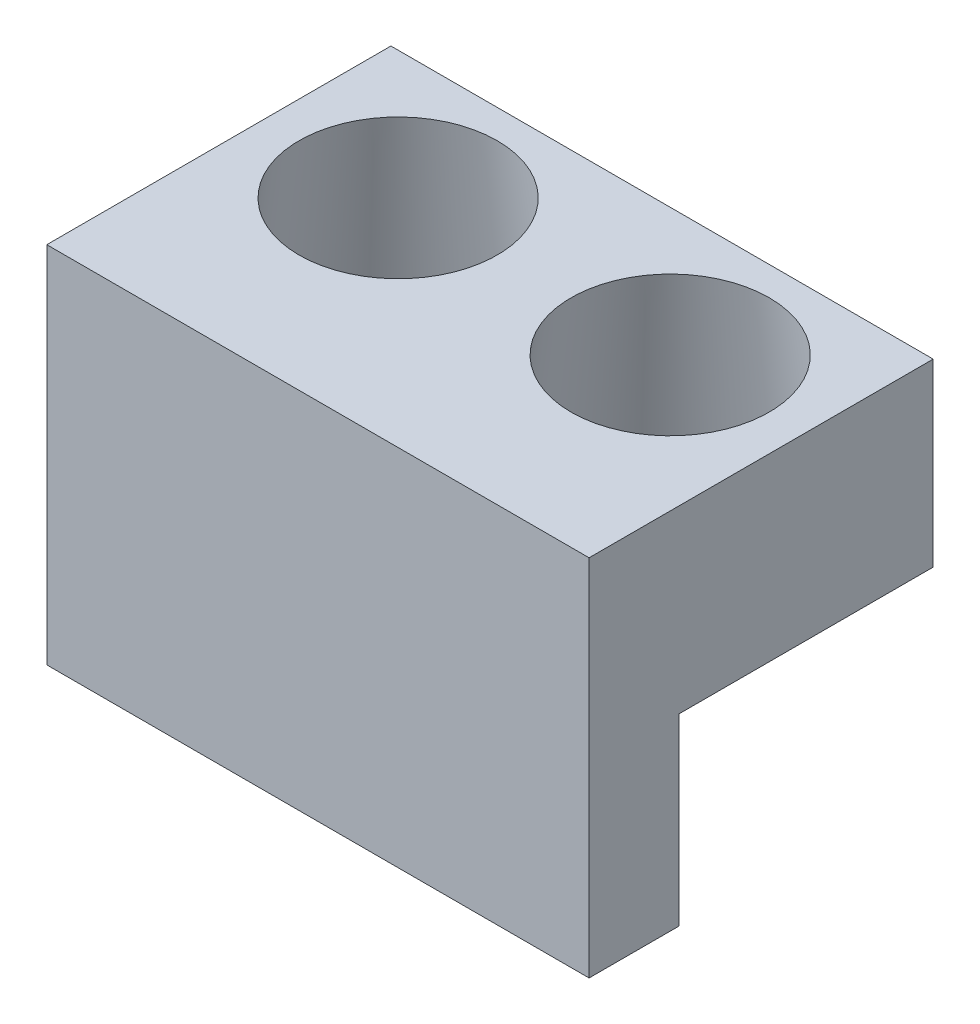
ISO-10303-21;
HEADER;
FILE_DESCRIPTION(('STEP AP214'),'2;1');
FILE_NAME('part.step','',(''),(''),'','','');
FILE_SCHEMA(('AUTOMOTIVE_DESIGN { 1 0 10303 214 1 1 1 1 }'));
ENDSEC;
DATA;
#1=APPLICATION_CONTEXT('core data for automotive mechanical design processes');
#2=APPLICATION_PROTOCOL_DEFINITION('international standard','automotive_design',2000,#1);
#3=PRODUCT_CONTEXT('',#1,'mechanical');
#4=PRODUCT('Part','Part','',(#3));
#5=PRODUCT_RELATED_PRODUCT_CATEGORY('part','',(#4));
#6=PRODUCT_DEFINITION_FORMATION('','',#4);
#7=PRODUCT_DEFINITION_CONTEXT('part definition',#1,'design');
#8=PRODUCT_DEFINITION('design','',#6,#7);
#9=PRODUCT_DEFINITION_SHAPE('','',#8);
#10=(LENGTH_UNIT() NAMED_UNIT(*) SI_UNIT(.MILLI.,.METRE.));
#11=(NAMED_UNIT(*) PLANE_ANGLE_UNIT() SI_UNIT($,.RADIAN.));
#12=(NAMED_UNIT(*) SI_UNIT($,.STERADIAN.) SOLID_ANGLE_UNIT());
#13=UNCERTAINTY_MEASURE_WITH_UNIT(LENGTH_MEASURE(1.E-05),#10,'distance_accuracy_value','');
#14=(GEOMETRIC_REPRESENTATION_CONTEXT(3) GLOBAL_UNCERTAINTY_ASSIGNED_CONTEXT((#13)) GLOBAL_UNIT_ASSIGNED_CONTEXT((#10,
#11,#12)) REPRESENTATION_CONTEXT('',''));
#15=CARTESIAN_POINT('',(0.,0.,0.));
#16=DIRECTION('',(0.,0.,1.));
#17=DIRECTION('',(1.,0.,0.));
#18=AXIS2_PLACEMENT_3D('',#15,#16,#17);
#19=CARTESIAN_POINT('',(38.227,51.308,12.7));
#20=DIRECTION('',(-1.,0.,0.));
#21=DIRECTION('',(0.,0.,1.));
#22=AXIS2_PLACEMENT_3D('',#19,#20,#21);
#23=PLANE('',#22);
#24=DIRECTION('',(0.,0.,-1.));
#25=VECTOR('',#24,1.);
#26=CARTESIAN_POINT('',(38.227,0.,12.7));
#27=LINE('',#26,#25);
#28=CARTESIAN_POINT('',(38.227,0.,12.7));
#29=VERTEX_POINT('',#28);
#30=CARTESIAN_POINT('',(38.227,0.,0.));
#31=VERTEX_POINT('',#30);
#32=EDGE_CURVE('E106',#29,#31,#27,.T.);
#33=ORIENTED_EDGE('',*,*,#32,.T.);
#34=DIRECTION('',(0.,-1.,0.));
#35=VECTOR('',#34,1.);
#36=CARTESIAN_POINT('',(38.227,51.308,0.));
#37=LINE('',#36,#35);
#38=CARTESIAN_POINT('',(38.227,25.908,0.));
#39=VERTEX_POINT('',#38);
#40=EDGE_CURVE('E12',#39,#31,#37,.T.);
#41=ORIENTED_EDGE('',*,*,#40,.F.);
#42=DIRECTION('',(0.,0.,-1.));
#43=VECTOR('',#42,1.);
#44=CARTESIAN_POINT('',(38.227,25.908,-35.814));
#45=LINE('',#44,#43);
#46=CARTESIAN_POINT('',(38.227,25.908,-35.814));
#47=VERTEX_POINT('',#46);
#48=EDGE_CURVE('E62',#39,#47,#45,.T.);
#49=ORIENTED_EDGE('',*,*,#48,.T.);
#50=DIRECTION('',(0.,1.,0.));
#51=VECTOR('',#50,1.);
#52=CARTESIAN_POINT('',(38.227,25.908,-35.814));
#53=LINE('',#52,#51);
#54=CARTESIAN_POINT('',(38.227,51.308,-35.814));
#55=VERTEX_POINT('',#54);
#56=EDGE_CURVE('E121',#47,#55,#53,.T.);
#57=ORIENTED_EDGE('',*,*,#56,.T.);
#58=DIRECTION('',(0.,0.,-1.));
#59=VECTOR('',#58,1.);
#60=CARTESIAN_POINT('',(38.227,51.308,12.7));
#61=LINE('',#60,#59);
#62=CARTESIAN_POINT('',(38.227,51.308,12.7));
#63=VERTEX_POINT('',#62);
#64=EDGE_CURVE('E100',#63,#55,#61,.T.);
#65=ORIENTED_EDGE('',*,*,#64,.F.);
#66=DIRECTION('',(0.,-1.,0.));
#67=VECTOR('',#66,1.);
#68=CARTESIAN_POINT('',(38.227,51.308,12.7));
#69=LINE('',#68,#67);
#70=EDGE_CURVE('E92',#63,#29,#69,.T.);
#71=ORIENTED_EDGE('',*,*,#70,.T.);
#72=EDGE_LOOP('',(#33,#41,#49,#57,#65,#71));
#73=FACE_BOUND('',#72,.T.);
#74=ADVANCED_FACE('F47',(#73),#23,.F.);
#75=CARTESIAN_POINT('',(-38.227,51.308,0.));
#76=DIRECTION('',(0.,0.,1.));
#77=DIRECTION('',(1.,0.,0.));
#78=AXIS2_PLACEMENT_3D('',#75,#76,#77);
#79=PLANE('',#78);
#80=DIRECTION('',(0.,-1.,0.));
#81=VECTOR('',#80,1.);
#82=CARTESIAN_POINT('',(-38.227,51.308,0.));
#83=LINE('',#82,#81);
#84=CARTESIAN_POINT('',(-38.227,25.908,0.));
#85=VERTEX_POINT('',#84);
#86=CARTESIAN_POINT('',(-38.227,0.,0.));
#87=VERTEX_POINT('',#86);
#88=EDGE_CURVE('E55',#85,#87,#83,.T.);
#89=ORIENTED_EDGE('',*,*,#88,.F.);
#90=DIRECTION('',(1.,0.,0.));
#91=VECTOR('',#90,1.);
#92=CARTESIAN_POINT('',(38.227,25.908,0.));
#93=LINE('',#92,#91);
#94=EDGE_CURVE('E139',#85,#39,#93,.T.);
#95=ORIENTED_EDGE('',*,*,#94,.T.);
#96=ORIENTED_EDGE('',*,*,#40,.T.);
#97=DIRECTION('',(-1.,0.,0.));
#98=VECTOR('',#97,1.);
#99=CARTESIAN_POINT('',(-38.227,0.,0.));
#100=LINE('',#99,#98);
#101=EDGE_CURVE('E113',#31,#87,#100,.T.);
#102=ORIENTED_EDGE('',*,*,#101,.T.);
#103=EDGE_LOOP('',(#89,#95,#96,#102));
#104=FACE_BOUND('',#103,.T.);
#105=ADVANCED_FACE('F138',(#104),#79,.F.);
#106=CARTESIAN_POINT('',(-38.227,51.308,0.));
#107=DIRECTION('',(1.,0.,0.));
#108=DIRECTION('',(0.,0.,-1.));
#109=AXIS2_PLACEMENT_3D('',#106,#107,#108);
#110=PLANE('',#109);
#111=DIRECTION('',(0.,0.,1.));
#112=VECTOR('',#111,1.);
#113=CARTESIAN_POINT('',(-38.227,0.,0.));
#114=LINE('',#113,#112);
#115=CARTESIAN_POINT('',(-38.227,0.,12.7));
#116=VERTEX_POINT('',#115);
#117=EDGE_CURVE('E101',#87,#116,#114,.T.);
#118=ORIENTED_EDGE('',*,*,#117,.T.);
#119=DIRECTION('',(0.,-1.,0.));
#120=VECTOR('',#119,1.);
#121=CARTESIAN_POINT('',(-38.227,51.308,12.7));
#122=LINE('',#121,#120);
#123=CARTESIAN_POINT('',(-38.227,51.308,12.7));
#124=VERTEX_POINT('',#123);
#125=EDGE_CURVE('E95',#124,#116,#122,.T.);
#126=ORIENTED_EDGE('',*,*,#125,.F.);
#127=DIRECTION('',(0.,0.,1.));
#128=VECTOR('',#127,1.);
#129=CARTESIAN_POINT('',(-38.227,51.308,0.));
#130=LINE('',#129,#128);
#131=CARTESIAN_POINT('',(-38.227,51.308,-35.814));
#132=VERTEX_POINT('',#131);
#133=EDGE_CURVE('E167',#132,#124,#130,.T.);
#134=ORIENTED_EDGE('',*,*,#133,.F.);
#135=DIRECTION('',(0.,1.,0.));
#136=VECTOR('',#135,1.);
#137=CARTESIAN_POINT('',(-38.227,25.908,-35.814));
#138=LINE('',#137,#136);
#139=CARTESIAN_POINT('',(-38.227,25.908,-35.814));
#140=VERTEX_POINT('',#139);
#141=EDGE_CURVE('E115',#140,#132,#138,.T.);
#142=ORIENTED_EDGE('',*,*,#141,.F.);
#143=DIRECTION('',(0.,0.,1.));
#144=VECTOR('',#143,1.);
#145=CARTESIAN_POINT('',(-38.227,25.908,0.));
#146=LINE('',#145,#144);
#147=EDGE_CURVE('E136',#140,#85,#146,.T.);
#148=ORIENTED_EDGE('',*,*,#147,.T.);
#149=ORIENTED_EDGE('',*,*,#88,.T.);
#150=EDGE_LOOP('',(#118,#126,#134,#142,#148,#149));
#151=FACE_BOUND('',#150,.T.);
#152=ADVANCED_FACE('F133',(#151),#110,.F.);
#153=CARTESIAN_POINT('',(-38.227,51.308,12.7));
#154=DIRECTION('',(0.,0.,-1.));
#155=DIRECTION('',(-1.,0.,0.));
#156=AXIS2_PLACEMENT_3D('',#153,#154,#155);
#157=PLANE('',#156);
#158=DIRECTION('',(1.,0.,0.));
#159=VECTOR('',#158,1.);
#160=CARTESIAN_POINT('',(-38.227,0.,12.7));
#161=LINE('',#160,#159);
#162=EDGE_CURVE('E89',#116,#29,#161,.T.);
#163=ORIENTED_EDGE('',*,*,#162,.T.);
#164=ORIENTED_EDGE('',*,*,#70,.F.);
#165=DIRECTION('',(1.,0.,0.));
#166=VECTOR('',#165,1.);
#167=CARTESIAN_POINT('',(-38.227,51.308,12.7));
#168=LINE('',#167,#166);
#169=EDGE_CURVE('E71',#124,#63,#168,.T.);
#170=ORIENTED_EDGE('',*,*,#169,.F.);
#171=ORIENTED_EDGE('',*,*,#125,.T.);
#172=EDGE_LOOP('',(#163,#164,#170,#171));
#173=FACE_BOUND('',#172,.T.);
#174=ADVANCED_FACE('F91',(#173),#157,.F.);
#175=CARTESIAN_POINT('',(0.,51.308,0.));
#176=DIRECTION('',(0.,-1.,0.));
#177=DIRECTION('',(0.,0.,-1.));
#178=AXIS2_PLACEMENT_3D('',#175,#176,#177);
#179=PLANE('',#178);
#180=CARTESIAN_POINT('',(-19.177,51.308,-17.78));
#181=DIRECTION('',(0.,1.,0.));
#182=DIRECTION('',(0.,0.,1.));
#183=AXIS2_PLACEMENT_3D('',#180,#181,#182);
#184=CIRCLE('',#183,13.97);
#185=CARTESIAN_POINT('',(-19.177,51.308,-3.81));
#186=VERTEX_POINT('',#185);
#187=EDGE_CURVE('E212',#186,#186,#184,.T.);
#188=ORIENTED_EDGE('',*,*,#187,.F.);
#189=EDGE_LOOP('',(#188));
#190=FACE_BOUND('',#189,.T.);
#191=CARTESIAN_POINT('',(19.177,51.308,-17.78));
#192=DIRECTION('',(0.,1.,0.));
#193=DIRECTION('',(0.,0.,1.));
#194=AXIS2_PLACEMENT_3D('',#191,#192,#193);
#195=CIRCLE('',#194,13.97);
#196=CARTESIAN_POINT('',(19.177,51.308,-3.80999999999999));
#197=VERTEX_POINT('',#196);
#198=EDGE_CURVE('E162',#197,#197,#195,.T.);
#199=ORIENTED_EDGE('',*,*,#198,.F.);
#200=EDGE_LOOP('',(#199));
#201=FACE_BOUND('',#200,.T.);
#202=ORIENTED_EDGE('',*,*,#64,.T.);
#203=DIRECTION('',(-1.,0.,0.));
#204=VECTOR('',#203,1.);
#205=CARTESIAN_POINT('',(-38.227,51.308,-35.814));
#206=LINE('',#205,#204);
#207=EDGE_CURVE('E154',#55,#132,#206,.T.);
#208=ORIENTED_EDGE('',*,*,#207,.T.);
#209=ORIENTED_EDGE('',*,*,#133,.T.);
#210=ORIENTED_EDGE('',*,*,#169,.T.);
#211=EDGE_LOOP('',(#202,#208,#209,#210));
#212=FACE_BOUND('',#211,.T.);
#213=ADVANCED_FACE('F171',(#190,#201,#212),#179,.F.);
#214=CARTESIAN_POINT('',(0.,0.,0.));
#215=DIRECTION('',(0.,-1.,0.));
#216=DIRECTION('',(0.,0.,-1.));
#217=AXIS2_PLACEMENT_3D('',#214,#215,#216);
#218=PLANE('',#217);
#219=ORIENTED_EDGE('',*,*,#32,.F.);
#220=ORIENTED_EDGE('',*,*,#162,.F.);
#221=ORIENTED_EDGE('',*,*,#117,.F.);
#222=ORIENTED_EDGE('',*,*,#101,.F.);
#223=EDGE_LOOP('',(#219,#220,#221,#222));
#224=FACE_BOUND('',#223,.T.);
#225=ADVANCED_FACE('F111',(#224),#218,.T.);
#226=CARTESIAN_POINT('',(-38.227,25.908,-35.814));
#227=DIRECTION('',(0.,0.,-1.));
#228=DIRECTION('',(-1.,0.,0.));
#229=AXIS2_PLACEMENT_3D('',#226,#227,#228);
#230=PLANE('',#229);
#231=ORIENTED_EDGE('',*,*,#207,.F.);
#232=ORIENTED_EDGE('',*,*,#56,.F.);
#233=DIRECTION('',(-1.,0.,0.));
#234=VECTOR('',#233,1.);
#235=CARTESIAN_POINT('',(-38.227,25.908,-35.814));
#236=LINE('',#235,#234);
#237=EDGE_CURVE('E148',#47,#140,#236,.T.);
#238=ORIENTED_EDGE('',*,*,#237,.T.);
#239=ORIENTED_EDGE('',*,*,#141,.T.);
#240=EDGE_LOOP('',(#231,#232,#238,#239));
#241=FACE_BOUND('',#240,.T.);
#242=ADVANCED_FACE('F173',(#241),#230,.T.);
#243=CARTESIAN_POINT('',(0.,25.908,0.));
#244=DIRECTION('',(0.,-1.,0.));
#245=DIRECTION('',(0.,0.,-1.));
#246=AXIS2_PLACEMENT_3D('',#243,#244,#245);
#247=PLANE('',#246);
#248=CARTESIAN_POINT('',(-19.177,25.908,-17.78));
#249=DIRECTION('',(0.,-1.,0.));
#250=DIRECTION('',(0.,0.,-1.));
#251=AXIS2_PLACEMENT_3D('',#248,#249,#250);
#252=CIRCLE('',#251,17.145);
#253=CARTESIAN_POINT('',(-19.177,25.908,-34.925));
#254=VERTEX_POINT('',#253);
#255=EDGE_CURVE('E224',#254,#254,#252,.T.);
#256=ORIENTED_EDGE('',*,*,#255,.F.);
#257=EDGE_LOOP('',(#256));
#258=FACE_BOUND('',#257,.T.);
#259=CARTESIAN_POINT('',(19.177,25.908,-17.78));
#260=DIRECTION('',(0.,-1.,0.));
#261=DIRECTION('',(0.,0.,-1.));
#262=AXIS2_PLACEMENT_3D('',#259,#260,#261);
#263=CIRCLE('',#262,17.145);
#264=CARTESIAN_POINT('',(19.177,25.908,-34.925));
#265=VERTEX_POINT('',#264);
#266=EDGE_CURVE('E217',#265,#265,#263,.T.);
#267=ORIENTED_EDGE('',*,*,#266,.F.);
#268=EDGE_LOOP('',(#267));
#269=FACE_BOUND('',#268,.T.);
#270=ORIENTED_EDGE('',*,*,#94,.F.);
#271=ORIENTED_EDGE('',*,*,#147,.F.);
#272=ORIENTED_EDGE('',*,*,#237,.F.);
#273=ORIENTED_EDGE('',*,*,#48,.F.);
#274=EDGE_LOOP('',(#270,#271,#272,#273));
#275=FACE_BOUND('',#274,.T.);
#276=ADVANCED_FACE('F175',(#258,#269,#275),#247,.T.);
#277=CARTESIAN_POINT('',(19.177,51.308,-17.78));
#278=DIRECTION('',(0.,-1.,0.));
#279=DIRECTION('',(0.,0.,-1.));
#280=AXIS2_PLACEMENT_3D('',#277,#278,#279);
#281=CONICAL_SURFACE('',#280,13.97,0.124354994546761);
#282=ORIENTED_EDGE('',*,*,#266,.T.);
#283=EDGE_LOOP('',(#282));
#284=FACE_BOUND('',#283,.T.);
#285=ORIENTED_EDGE('',*,*,#198,.T.);
#286=EDGE_LOOP('',(#285));
#287=FACE_BOUND('',#286,.T.);
#288=ADVANCED_FACE('F179',(#284,#287),#281,.F.);
#289=CARTESIAN_POINT('',(-19.177,51.308,-17.78));
#290=DIRECTION('',(0.,-1.,0.));
#291=DIRECTION('',(0.,0.,-1.));
#292=AXIS2_PLACEMENT_3D('',#289,#290,#291);
#293=CONICAL_SURFACE('',#292,13.97,0.124354994546761);
#294=ORIENTED_EDGE('',*,*,#255,.T.);
#295=EDGE_LOOP('',(#294));
#296=FACE_BOUND('',#295,.T.);
#297=ORIENTED_EDGE('',*,*,#187,.T.);
#298=EDGE_LOOP('',(#297));
#299=FACE_BOUND('',#298,.T.);
#300=ADVANCED_FACE('F186',(#296,#299),#293,.F.);
#301=CLOSED_SHELL('',(#74,#105,#152,#174,#213,#225,#242,#276,#288,#300));
#302=MANIFOLD_SOLID_BREP('B2',#301);
#303=ADVANCED_BREP_SHAPE_REPRESENTATION('',(#18,#302),#14);
#304=SHAPE_DEFINITION_REPRESENTATION(#9,#303);
ENDSEC;
END-ISO-10303-21;
